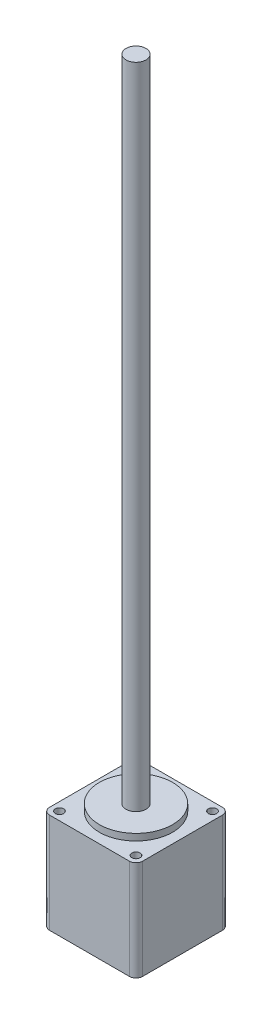
ISO-10303-21;
HEADER;
FILE_DESCRIPTION(('STEP AP214'),'2;1');
FILE_NAME('part.step','',(''),(''),'','','');
FILE_SCHEMA(('AUTOMOTIVE_DESIGN { 1 0 10303 214 1 1 1 1 }'));
ENDSEC;
DATA;
#1=APPLICATION_CONTEXT('core data for automotive mechanical design processes');
#2=APPLICATION_PROTOCOL_DEFINITION('international standard','automotive_design',2000,#1);
#3=PRODUCT_CONTEXT('',#1,'mechanical');
#4=PRODUCT('Part','Part','',(#3));
#5=PRODUCT_RELATED_PRODUCT_CATEGORY('part','',(#4));
#6=PRODUCT_DEFINITION_FORMATION('','',#4);
#7=PRODUCT_DEFINITION_CONTEXT('part definition',#1,'design');
#8=PRODUCT_DEFINITION('design','',#6,#7);
#9=PRODUCT_DEFINITION_SHAPE('','',#8);
#10=(LENGTH_UNIT() NAMED_UNIT(*) SI_UNIT(.MILLI.,.METRE.));
#11=(NAMED_UNIT(*) PLANE_ANGLE_UNIT() SI_UNIT($,.RADIAN.));
#12=(NAMED_UNIT(*) SI_UNIT($,.STERADIAN.) SOLID_ANGLE_UNIT());
#13=UNCERTAINTY_MEASURE_WITH_UNIT(LENGTH_MEASURE(1.E-05),#10,'distance_accuracy_value','');
#14=(GEOMETRIC_REPRESENTATION_CONTEXT(3) GLOBAL_UNCERTAINTY_ASSIGNED_CONTEXT((#13)) GLOBAL_UNIT_ASSIGNED_CONTEXT((#10,
#11,#12)) REPRESENTATION_CONTEXT('',''));
#15=CARTESIAN_POINT('',(0.,0.,0.));
#16=DIRECTION('',(0.,0.,1.));
#17=DIRECTION('',(1.,0.,0.));
#18=AXIS2_PLACEMENT_3D('',#15,#16,#17);
#19=CARTESIAN_POINT('',(0.,30.,0.));
#20=DIRECTION('',(0.,-1.,0.));
#21=DIRECTION('',(0.,0.,-1.));
#22=AXIS2_PLACEMENT_3D('',#19,#20,#21);
#23=PLANE('',#22);
#24=CARTESIAN_POINT('',(14.,30.,-14.));
#25=DIRECTION('',(0.,1.,0.));
#26=DIRECTION('',(0.,0.,1.));
#27=AXIS2_PLACEMENT_3D('',#24,#25,#26);
#28=CIRCLE('',#27,11.);
#29=CARTESIAN_POINT('',(14.,30.,-3.));
#30=VERTEX_POINT('',#29);
#31=EDGE_CURVE('E219',#30,#30,#28,.T.);
#32=ORIENTED_EDGE('',*,*,#31,.F.);
#33=EDGE_LOOP('',(#32));
#34=FACE_BOUND('',#33,.T.);
#35=DIRECTION('',(-1.,0.,0.));
#36=VECTOR('',#35,1.);
#37=CARTESIAN_POINT('',(0.,30.,-28.));
#38=LINE('',#37,#36);
#39=CARTESIAN_POINT('',(26.,30.,-28.));
#40=VERTEX_POINT('',#39);
#41=CARTESIAN_POINT('',(2.,30.,-28.));
#42=VERTEX_POINT('',#41);
#43=EDGE_CURVE('E156',#40,#42,#38,.T.);
#44=ORIENTED_EDGE('',*,*,#43,.T.);
#45=CARTESIAN_POINT('',(2.,30.,-26.));
#46=DIRECTION('',(0.,-1.,0.));
#47=DIRECTION('',(0.,0.,-1.));
#48=AXIS2_PLACEMENT_3D('',#45,#46,#47);
#49=CIRCLE('',#48,2.);
#50=CARTESIAN_POINT('',(0.,30.,-26.));
#51=VERTEX_POINT('',#50);
#52=EDGE_CURVE('E186',#42,#51,#49,.F.);
#53=ORIENTED_EDGE('',*,*,#52,.T.);
#54=DIRECTION('',(0.,0.,1.));
#55=VECTOR('',#54,1.);
#56=CARTESIAN_POINT('',(0.,30.,0.));
#57=LINE('',#56,#55);
#58=CARTESIAN_POINT('',(0.,30.,-2.));
#59=VERTEX_POINT('',#58);
#60=EDGE_CURVE('E134',#51,#59,#57,.T.);
#61=ORIENTED_EDGE('',*,*,#60,.T.);
#62=CARTESIAN_POINT('',(2.,30.,-2.));
#63=DIRECTION('',(0.,-1.,0.));
#64=DIRECTION('',(0.,0.,-1.));
#65=AXIS2_PLACEMENT_3D('',#62,#63,#64);
#66=CIRCLE('',#65,2.);
#67=CARTESIAN_POINT('',(2.,30.,0.));
#68=VERTEX_POINT('',#67);
#69=EDGE_CURVE('E180',#59,#68,#66,.F.);
#70=ORIENTED_EDGE('',*,*,#69,.T.);
#71=DIRECTION('',(1.,0.,0.));
#72=VECTOR('',#71,1.);
#73=CARTESIAN_POINT('',(0.,30.,0.));
#74=LINE('',#73,#72);
#75=CARTESIAN_POINT('',(26.,30.,0.));
#76=VERTEX_POINT('',#75);
#77=EDGE_CURVE('E199',#68,#76,#74,.T.);
#78=ORIENTED_EDGE('',*,*,#77,.T.);
#79=CARTESIAN_POINT('',(26.,30.,-2.));
#80=DIRECTION('',(0.,-1.,0.));
#81=DIRECTION('',(0.,0.,-1.));
#82=AXIS2_PLACEMENT_3D('',#79,#80,#81);
#83=CIRCLE('',#82,2.);
#84=CARTESIAN_POINT('',(28.,30.,-2.));
#85=VERTEX_POINT('',#84);
#86=EDGE_CURVE('E68',#76,#85,#83,.F.);
#87=ORIENTED_EDGE('',*,*,#86,.T.);
#88=DIRECTION('',(0.,0.,-1.));
#89=VECTOR('',#88,1.);
#90=CARTESIAN_POINT('',(28.,30.,0.));
#91=LINE('',#90,#89);
#92=CARTESIAN_POINT('',(28.,30.,-26.));
#93=VERTEX_POINT('',#92);
#94=EDGE_CURVE('E206',#85,#93,#91,.T.);
#95=ORIENTED_EDGE('',*,*,#94,.T.);
#96=CARTESIAN_POINT('',(26.,30.,-26.));
#97=DIRECTION('',(0.,-1.,0.));
#98=DIRECTION('',(0.,0.,-1.));
#99=AXIS2_PLACEMENT_3D('',#96,#97,#98);
#100=CIRCLE('',#99,2.);
#101=EDGE_CURVE('E183',#93,#40,#100,.F.);
#102=ORIENTED_EDGE('',*,*,#101,.T.);
#103=EDGE_LOOP('',(#44,#53,#61,#70,#78,#87,#95,#102));
#104=FACE_BOUND('',#103,.T.);
#105=CARTESIAN_POINT('',(2.5,30.,-25.5));
#106=DIRECTION('',(0.,1.,0.));
#107=DIRECTION('',(0.,0.,1.));
#108=AXIS2_PLACEMENT_3D('',#105,#106,#107);
#109=CIRCLE('',#108,1.25);
#110=CARTESIAN_POINT('',(2.5,30.,-24.25));
#111=VERTEX_POINT('',#110);
#112=EDGE_CURVE('E145',#111,#111,#109,.T.);
#113=ORIENTED_EDGE('',*,*,#112,.F.);
#114=EDGE_LOOP('',(#113));
#115=FACE_BOUND('',#114,.T.);
#116=CARTESIAN_POINT('',(2.5,30.,-2.5));
#117=DIRECTION('',(0.,1.,0.));
#118=DIRECTION('',(0.,0.,1.));
#119=AXIS2_PLACEMENT_3D('',#116,#117,#118);
#120=CIRCLE('',#119,1.25);
#121=CARTESIAN_POINT('',(2.5,30.,-1.25));
#122=VERTEX_POINT('',#121);
#123=EDGE_CURVE('E229',#122,#122,#120,.T.);
#124=ORIENTED_EDGE('',*,*,#123,.F.);
#125=EDGE_LOOP('',(#124));
#126=FACE_BOUND('',#125,.T.);
#127=CARTESIAN_POINT('',(25.5,30.,-2.5));
#128=DIRECTION('',(0.,1.,0.));
#129=DIRECTION('',(0.,0.,1.));
#130=AXIS2_PLACEMENT_3D('',#127,#128,#129);
#131=CIRCLE('',#130,1.25);
#132=CARTESIAN_POINT('',(25.5,30.,-1.25));
#133=VERTEX_POINT('',#132);
#134=EDGE_CURVE('E235',#133,#133,#131,.T.);
#135=ORIENTED_EDGE('',*,*,#134,.F.);
#136=EDGE_LOOP('',(#135));
#137=FACE_BOUND('',#136,.T.);
#138=CARTESIAN_POINT('',(25.5,30.,-25.5));
#139=DIRECTION('',(0.,1.,0.));
#140=DIRECTION('',(0.,0.,1.));
#141=AXIS2_PLACEMENT_3D('',#138,#139,#140);
#142=CIRCLE('',#141,1.25);
#143=CARTESIAN_POINT('',(25.5,30.,-24.25));
#144=VERTEX_POINT('',#143);
#145=EDGE_CURVE('E243',#144,#144,#142,.T.);
#146=ORIENTED_EDGE('',*,*,#145,.F.);
#147=EDGE_LOOP('',(#146));
#148=FACE_BOUND('',#147,.T.);
#149=ADVANCED_FACE('F45',(#34,#104,#115,#126,#137,#148),#23,.F.);
#150=CARTESIAN_POINT('',(0.,0.,0.));
#151=DIRECTION('',(0.,-1.,0.));
#152=DIRECTION('',(0.,0.,-1.));
#153=AXIS2_PLACEMENT_3D('',#150,#151,#152);
#154=PLANE('',#153);
#155=CARTESIAN_POINT('',(25.5,0.,-2.5));
#156=DIRECTION('',(0.,1.,0.));
#157=DIRECTION('',(0.,0.,1.));
#158=AXIS2_PLACEMENT_3D('',#155,#156,#157);
#159=CIRCLE('',#158,1.25);
#160=CARTESIAN_POINT('',(25.5,0.,-1.25));
#161=VERTEX_POINT('',#160);
#162=EDGE_CURVE('E239',#161,#161,#159,.T.);
#163=ORIENTED_EDGE('',*,*,#162,.T.);
#164=EDGE_LOOP('',(#163));
#165=FACE_BOUND('',#164,.T.);
#166=CARTESIAN_POINT('',(2.5,0.,-25.5));
#167=DIRECTION('',(0.,1.,0.));
#168=DIRECTION('',(0.,0.,1.));
#169=AXIS2_PLACEMENT_3D('',#166,#167,#168);
#170=CIRCLE('',#169,1.25);
#171=CARTESIAN_POINT('',(2.5,0.,-24.25));
#172=VERTEX_POINT('',#171);
#173=EDGE_CURVE('E153',#172,#172,#170,.T.);
#174=ORIENTED_EDGE('',*,*,#173,.T.);
#175=EDGE_LOOP('',(#174));
#176=FACE_BOUND('',#175,.T.);
#177=DIRECTION('',(0.,0.,1.));
#178=VECTOR('',#177,1.);
#179=CARTESIAN_POINT('',(0.,0.,0.));
#180=LINE('',#179,#178);
#181=CARTESIAN_POINT('',(0.,0.,-26.));
#182=VERTEX_POINT('',#181);
#183=CARTESIAN_POINT('',(0.,0.,-2.));
#184=VERTEX_POINT('',#183);
#185=EDGE_CURVE('E131',#182,#184,#180,.T.);
#186=ORIENTED_EDGE('',*,*,#185,.F.);
#187=CARTESIAN_POINT('',(2.,0.,-26.));
#188=DIRECTION('',(0.,-1.,0.));
#189=DIRECTION('',(0.,0.,-1.));
#190=AXIS2_PLACEMENT_3D('',#187,#188,#189);
#191=CIRCLE('',#190,2.);
#192=CARTESIAN_POINT('',(2.,0.,-28.));
#193=VERTEX_POINT('',#192);
#194=EDGE_CURVE('E113',#182,#193,#191,.T.);
#195=ORIENTED_EDGE('',*,*,#194,.T.);
#196=DIRECTION('',(-1.,0.,0.));
#197=VECTOR('',#196,1.);
#198=CARTESIAN_POINT('',(0.,0.,-28.));
#199=LINE('',#198,#197);
#200=CARTESIAN_POINT('',(26.,0.,-28.));
#201=VERTEX_POINT('',#200);
#202=EDGE_CURVE('E161',#201,#193,#199,.T.);
#203=ORIENTED_EDGE('',*,*,#202,.F.);
#204=CARTESIAN_POINT('',(26.,0.,-26.));
#205=DIRECTION('',(0.,-1.,0.));
#206=DIRECTION('',(0.,0.,-1.));
#207=AXIS2_PLACEMENT_3D('',#204,#205,#206);
#208=CIRCLE('',#207,2.);
#209=CARTESIAN_POINT('',(28.,0.,-26.));
#210=VERTEX_POINT('',#209);
#211=EDGE_CURVE('E125',#201,#210,#208,.T.);
#212=ORIENTED_EDGE('',*,*,#211,.T.);
#213=DIRECTION('',(0.,0.,-1.));
#214=VECTOR('',#213,1.);
#215=CARTESIAN_POINT('',(28.,0.,0.));
#216=LINE('',#215,#214);
#217=CARTESIAN_POINT('',(28.,0.,-2.));
#218=VERTEX_POINT('',#217);
#219=EDGE_CURVE('E150',#218,#210,#216,.T.);
#220=ORIENTED_EDGE('',*,*,#219,.F.);
#221=CARTESIAN_POINT('',(26.,0.,-2.));
#222=DIRECTION('',(0.,-1.,0.));
#223=DIRECTION('',(0.,0.,-1.));
#224=AXIS2_PLACEMENT_3D('',#221,#222,#223);
#225=CIRCLE('',#224,2.);
#226=CARTESIAN_POINT('',(26.,0.,0.));
#227=VERTEX_POINT('',#226);
#228=EDGE_CURVE('E136',#218,#227,#225,.T.);
#229=ORIENTED_EDGE('',*,*,#228,.T.);
#230=DIRECTION('',(1.,0.,0.));
#231=VECTOR('',#230,1.);
#232=CARTESIAN_POINT('',(0.,0.,0.));
#233=LINE('',#232,#231);
#234=CARTESIAN_POINT('',(2.,0.,0.));
#235=VERTEX_POINT('',#234);
#236=EDGE_CURVE('E144',#235,#227,#233,.T.);
#237=ORIENTED_EDGE('',*,*,#236,.F.);
#238=CARTESIAN_POINT('',(2.,0.,-2.));
#239=DIRECTION('',(0.,-1.,0.));
#240=DIRECTION('',(0.,0.,-1.));
#241=AXIS2_PLACEMENT_3D('',#238,#239,#240);
#242=CIRCLE('',#241,2.);
#243=EDGE_CURVE('E142',#235,#184,#242,.T.);
#244=ORIENTED_EDGE('',*,*,#243,.T.);
#245=EDGE_LOOP('',(#186,#195,#203,#212,#220,#229,#237,#244));
#246=FACE_BOUND('',#245,.T.);
#247=CARTESIAN_POINT('',(2.5,0.,-2.5));
#248=DIRECTION('',(0.,1.,0.));
#249=DIRECTION('',(0.,0.,1.));
#250=AXIS2_PLACEMENT_3D('',#247,#248,#249);
#251=CIRCLE('',#250,1.25);
#252=CARTESIAN_POINT('',(2.5,0.,-1.25));
#253=VERTEX_POINT('',#252);
#254=EDGE_CURVE('E231',#253,#253,#251,.T.);
#255=ORIENTED_EDGE('',*,*,#254,.T.);
#256=EDGE_LOOP('',(#255));
#257=FACE_BOUND('',#256,.T.);
#258=CARTESIAN_POINT('',(25.5,0.,-25.5));
#259=DIRECTION('',(0.,1.,0.));
#260=DIRECTION('',(0.,0.,1.));
#261=AXIS2_PLACEMENT_3D('',#258,#259,#260);
#262=CIRCLE('',#261,1.25);
#263=CARTESIAN_POINT('',(25.5,0.,-24.25));
#264=VERTEX_POINT('',#263);
#265=EDGE_CURVE('E247',#264,#264,#262,.T.);
#266=ORIENTED_EDGE('',*,*,#265,.T.);
#267=EDGE_LOOP('',(#266));
#268=FACE_BOUND('',#267,.T.);
#269=ADVANCED_FACE('F139',(#165,#176,#246,#257,#268),#154,.T.);
#270=CARTESIAN_POINT('',(0.,30.,0.));
#271=DIRECTION('',(1.,0.,0.));
#272=DIRECTION('',(0.,0.,-1.));
#273=AXIS2_PLACEMENT_3D('',#270,#271,#272);
#274=PLANE('',#273);
#275=ORIENTED_EDGE('',*,*,#60,.F.);
#276=DIRECTION('',(0.,-1.,0.));
#277=VECTOR('',#276,1.);
#278=CARTESIAN_POINT('',(0.,30.,-26.));
#279=LINE('',#278,#277);
#280=EDGE_CURVE('E117',#51,#182,#279,.T.);
#281=ORIENTED_EDGE('',*,*,#280,.T.);
#282=ORIENTED_EDGE('',*,*,#185,.T.);
#283=DIRECTION('',(0.,-1.,0.));
#284=VECTOR('',#283,1.);
#285=CARTESIAN_POINT('',(0.,30.,-2.));
#286=LINE('',#285,#284);
#287=EDGE_CURVE('E137',#184,#59,#286,.F.);
#288=ORIENTED_EDGE('',*,*,#287,.T.);
#289=EDGE_LOOP('',(#275,#281,#282,#288));
#290=FACE_BOUND('',#289,.T.);
#291=ADVANCED_FACE('F130',(#290),#274,.F.);
#292=CARTESIAN_POINT('',(0.,30.,0.));
#293=DIRECTION('',(0.,0.,-1.));
#294=DIRECTION('',(-1.,0.,0.));
#295=AXIS2_PLACEMENT_3D('',#292,#293,#294);
#296=PLANE('',#295);
#297=ORIENTED_EDGE('',*,*,#77,.F.);
#298=DIRECTION('',(0.,-1.,0.));
#299=VECTOR('',#298,1.);
#300=CARTESIAN_POINT('',(2.,30.,0.));
#301=LINE('',#300,#299);
#302=EDGE_CURVE('E11',#68,#235,#301,.T.);
#303=ORIENTED_EDGE('',*,*,#302,.T.);
#304=ORIENTED_EDGE('',*,*,#236,.T.);
#305=DIRECTION('',(0.,-1.,0.));
#306=VECTOR('',#305,1.);
#307=CARTESIAN_POINT('',(26.,30.,0.));
#308=LINE('',#307,#306);
#309=EDGE_CURVE('E54',#227,#76,#308,.F.);
#310=ORIENTED_EDGE('',*,*,#309,.T.);
#311=EDGE_LOOP('',(#297,#303,#304,#310));
#312=FACE_BOUND('',#311,.T.);
#313=ADVANCED_FACE('F198',(#312),#296,.F.);
#314=CARTESIAN_POINT('',(28.,30.,0.));
#315=DIRECTION('',(-1.,0.,0.));
#316=DIRECTION('',(0.,0.,1.));
#317=AXIS2_PLACEMENT_3D('',#314,#315,#316);
#318=PLANE('',#317);
#319=ORIENTED_EDGE('',*,*,#219,.T.);
#320=DIRECTION('',(0.,-1.,0.));
#321=VECTOR('',#320,1.);
#322=CARTESIAN_POINT('',(28.,30.,-26.));
#323=LINE('',#322,#321);
#324=EDGE_CURVE('E61',#210,#93,#323,.F.);
#325=ORIENTED_EDGE('',*,*,#324,.T.);
#326=ORIENTED_EDGE('',*,*,#94,.F.);
#327=DIRECTION('',(0.,-1.,0.));
#328=VECTOR('',#327,1.);
#329=CARTESIAN_POINT('',(28.,30.,-2.));
#330=LINE('',#329,#328);
#331=EDGE_CURVE('E189',#85,#218,#330,.T.);
#332=ORIENTED_EDGE('',*,*,#331,.T.);
#333=EDGE_LOOP('',(#319,#325,#326,#332));
#334=FACE_BOUND('',#333,.T.);
#335=ADVANCED_FACE('F210',(#334),#318,.F.);
#336=CARTESIAN_POINT('',(0.,30.,-28.));
#337=DIRECTION('',(0.,0.,1.));
#338=DIRECTION('',(1.,0.,0.));
#339=AXIS2_PLACEMENT_3D('',#336,#337,#338);
#340=PLANE('',#339);
#341=ORIENTED_EDGE('',*,*,#202,.T.);
#342=DIRECTION('',(0.,-1.,0.));
#343=VECTOR('',#342,1.);
#344=CARTESIAN_POINT('',(2.,30.,-28.));
#345=LINE('',#344,#343);
#346=EDGE_CURVE('E118',#193,#42,#345,.F.);
#347=ORIENTED_EDGE('',*,*,#346,.T.);
#348=ORIENTED_EDGE('',*,*,#43,.F.);
#349=DIRECTION('',(0.,-1.,0.));
#350=VECTOR('',#349,1.);
#351=CARTESIAN_POINT('',(26.,30.,-28.));
#352=LINE('',#351,#350);
#353=EDGE_CURVE('E124',#40,#201,#352,.T.);
#354=ORIENTED_EDGE('',*,*,#353,.T.);
#355=EDGE_LOOP('',(#341,#347,#348,#354));
#356=FACE_BOUND('',#355,.T.);
#357=ADVANCED_FACE('F217',(#356),#340,.F.);
#358=CARTESIAN_POINT('',(2.5,30.,-25.5));
#359=DIRECTION('',(0.,-1.,0.));
#360=DIRECTION('',(0.,0.,-1.));
#361=AXIS2_PLACEMENT_3D('',#358,#359,#360);
#362=CYLINDRICAL_SURFACE('',#361,1.25);
#363=ORIENTED_EDGE('',*,*,#112,.T.);
#364=EDGE_LOOP('',(#363));
#365=FACE_BOUND('',#364,.T.);
#366=ORIENTED_EDGE('',*,*,#173,.F.);
#367=EDGE_LOOP('',(#366));
#368=FACE_BOUND('',#367,.T.);
#369=ADVANCED_FACE('F296',(#365,#368),#362,.F.);
#370=CARTESIAN_POINT('',(2.5,30.,-2.5));
#371=DIRECTION('',(0.,-1.,0.));
#372=DIRECTION('',(0.,0.,-1.));
#373=AXIS2_PLACEMENT_3D('',#370,#371,#372);
#374=CYLINDRICAL_SURFACE('',#373,1.25);
#375=ORIENTED_EDGE('',*,*,#123,.T.);
#376=EDGE_LOOP('',(#375));
#377=FACE_BOUND('',#376,.T.);
#378=ORIENTED_EDGE('',*,*,#254,.F.);
#379=EDGE_LOOP('',(#378));
#380=FACE_BOUND('',#379,.T.);
#381=ADVANCED_FACE('F379',(#377,#380),#374,.F.);
#382=CARTESIAN_POINT('',(25.5,30.,-2.5));
#383=DIRECTION('',(0.,-1.,0.));
#384=DIRECTION('',(0.,0.,-1.));
#385=AXIS2_PLACEMENT_3D('',#382,#383,#384);
#386=CYLINDRICAL_SURFACE('',#385,1.25);
#387=ORIENTED_EDGE('',*,*,#134,.T.);
#388=EDGE_LOOP('',(#387));
#389=FACE_BOUND('',#388,.T.);
#390=ORIENTED_EDGE('',*,*,#162,.F.);
#391=EDGE_LOOP('',(#390));
#392=FACE_BOUND('',#391,.T.);
#393=ADVANCED_FACE('F369',(#389,#392),#386,.F.);
#394=CARTESIAN_POINT('',(25.5,30.,-25.5));
#395=DIRECTION('',(0.,-1.,0.));
#396=DIRECTION('',(0.,0.,-1.));
#397=AXIS2_PLACEMENT_3D('',#394,#395,#396);
#398=CYLINDRICAL_SURFACE('',#397,1.25);
#399=ORIENTED_EDGE('',*,*,#145,.T.);
#400=EDGE_LOOP('',(#399));
#401=FACE_BOUND('',#400,.T.);
#402=ORIENTED_EDGE('',*,*,#265,.F.);
#403=EDGE_LOOP('',(#402));
#404=FACE_BOUND('',#403,.T.);
#405=ADVANCED_FACE('F283',(#401,#404),#398,.F.);
#406=CARTESIAN_POINT('',(14.,32.,-14.));
#407=DIRECTION('',(0.,-1.,0.));
#408=DIRECTION('',(0.,0.,-1.));
#409=AXIS2_PLACEMENT_3D('',#406,#407,#408);
#410=CYLINDRICAL_SURFACE('',#409,11.);
#411=CARTESIAN_POINT('',(14.,32.,-14.));
#412=DIRECTION('',(0.,1.,0.));
#413=DIRECTION('',(0.,0.,1.));
#414=AXIS2_PLACEMENT_3D('',#411,#412,#413);
#415=CIRCLE('',#414,11.);
#416=CARTESIAN_POINT('',(14.,32.,-3.));
#417=VERTEX_POINT('',#416);
#418=EDGE_CURVE('E251',#417,#417,#415,.T.);
#419=ORIENTED_EDGE('',*,*,#418,.F.);
#420=EDGE_LOOP('',(#419));
#421=FACE_BOUND('',#420,.T.);
#422=ORIENTED_EDGE('',*,*,#31,.T.);
#423=EDGE_LOOP('',(#422));
#424=FACE_BOUND('',#423,.T.);
#425=ADVANCED_FACE('F277',(#421,#424),#410,.T.);
#426=CARTESIAN_POINT('',(14.,32.,-14.));
#427=DIRECTION('',(0.,1.,0.));
#428=DIRECTION('',(0.,0.,1.));
#429=AXIS2_PLACEMENT_3D('',#426,#427,#428);
#430=PLANE('',#429);
#431=CARTESIAN_POINT('',(14.,32.,-14.));
#432=DIRECTION('',(0.,1.,0.));
#433=DIRECTION('',(0.,0.,1.));
#434=AXIS2_PLACEMENT_3D('',#431,#432,#433);
#435=CIRCLE('',#434,3.);
#436=CARTESIAN_POINT('',(14.,32.,-11.));
#437=VERTEX_POINT('',#436);
#438=EDGE_CURVE('E165',#437,#437,#435,.T.);
#439=ORIENTED_EDGE('',*,*,#438,.F.);
#440=EDGE_LOOP('',(#439));
#441=FACE_BOUND('',#440,.T.);
#442=ORIENTED_EDGE('',*,*,#418,.T.);
#443=EDGE_LOOP('',(#442));
#444=FACE_BOUND('',#443,.T.);
#445=ADVANCED_FACE('F271',(#441,#444),#430,.T.);
#446=CARTESIAN_POINT('',(14.,227.,-14.));
#447=DIRECTION('',(0.,-1.,0.));
#448=DIRECTION('',(0.,0.,-1.));
#449=AXIS2_PLACEMENT_3D('',#446,#447,#448);
#450=CYLINDRICAL_SURFACE('',#449,3.);
#451=CARTESIAN_POINT('',(14.,227.,-14.));
#452=DIRECTION('',(0.,1.,0.));
#453=DIRECTION('',(0.,0.,1.));
#454=AXIS2_PLACEMENT_3D('',#451,#452,#453);
#455=CIRCLE('',#454,3.);
#456=CARTESIAN_POINT('',(14.,227.,-11.));
#457=VERTEX_POINT('',#456);
#458=EDGE_CURVE('E258',#457,#457,#455,.T.);
#459=ORIENTED_EDGE('',*,*,#458,.F.);
#460=EDGE_LOOP('',(#459));
#461=FACE_BOUND('',#460,.T.);
#462=ORIENTED_EDGE('',*,*,#438,.T.);
#463=EDGE_LOOP('',(#462));
#464=FACE_BOUND('',#463,.T.);
#465=ADVANCED_FACE('F268',(#461,#464),#450,.T.);
#466=CARTESIAN_POINT('',(14.,227.,-14.));
#467=DIRECTION('',(0.,1.,0.));
#468=DIRECTION('',(0.,0.,1.));
#469=AXIS2_PLACEMENT_3D('',#466,#467,#468);
#470=PLANE('',#469);
#471=ORIENTED_EDGE('',*,*,#458,.T.);
#472=EDGE_LOOP('',(#471));
#473=FACE_BOUND('',#472,.T.);
#474=ADVANCED_FACE('F266',(#473),#470,.T.);
#475=CARTESIAN_POINT('',(2.,30.,-26.));
#476=DIRECTION('',(0.,-1.,0.));
#477=DIRECTION('',(0.,0.,-1.));
#478=AXIS2_PLACEMENT_3D('',#475,#476,#477);
#479=CYLINDRICAL_SURFACE('',#478,2.);
#480=ORIENTED_EDGE('',*,*,#52,.F.);
#481=ORIENTED_EDGE('',*,*,#346,.F.);
#482=ORIENTED_EDGE('',*,*,#194,.F.);
#483=ORIENTED_EDGE('',*,*,#280,.F.);
#484=EDGE_LOOP('',(#480,#481,#482,#483));
#485=FACE_BOUND('',#484,.T.);
#486=ADVANCED_FACE('F116',(#485),#479,.T.);
#487=CARTESIAN_POINT('',(26.,30.,-26.));
#488=DIRECTION('',(0.,-1.,0.));
#489=DIRECTION('',(0.,0.,-1.));
#490=AXIS2_PLACEMENT_3D('',#487,#488,#489);
#491=CYLINDRICAL_SURFACE('',#490,2.);
#492=ORIENTED_EDGE('',*,*,#101,.F.);
#493=ORIENTED_EDGE('',*,*,#324,.F.);
#494=ORIENTED_EDGE('',*,*,#211,.F.);
#495=ORIENTED_EDGE('',*,*,#353,.F.);
#496=EDGE_LOOP('',(#492,#493,#494,#495));
#497=FACE_BOUND('',#496,.T.);
#498=ADVANCED_FACE('F214',(#497),#491,.T.);
#499=CARTESIAN_POINT('',(2.,30.,-2.));
#500=DIRECTION('',(0.,-1.,0.));
#501=DIRECTION('',(0.,0.,-1.));
#502=AXIS2_PLACEMENT_3D('',#499,#500,#501);
#503=CYLINDRICAL_SURFACE('',#502,2.);
#504=ORIENTED_EDGE('',*,*,#69,.F.);
#505=ORIENTED_EDGE('',*,*,#287,.F.);
#506=ORIENTED_EDGE('',*,*,#243,.F.);
#507=ORIENTED_EDGE('',*,*,#302,.F.);
#508=EDGE_LOOP('',(#504,#505,#506,#507));
#509=FACE_BOUND('',#508,.T.);
#510=ADVANCED_FACE('F310',(#509),#503,.T.);
#511=CARTESIAN_POINT('',(26.,30.,-2.));
#512=DIRECTION('',(0.,-1.,0.));
#513=DIRECTION('',(0.,0.,-1.));
#514=AXIS2_PLACEMENT_3D('',#511,#512,#513);
#515=CYLINDRICAL_SURFACE('',#514,2.);
#516=ORIENTED_EDGE('',*,*,#86,.F.);
#517=ORIENTED_EDGE('',*,*,#309,.F.);
#518=ORIENTED_EDGE('',*,*,#228,.F.);
#519=ORIENTED_EDGE('',*,*,#331,.F.);
#520=EDGE_LOOP('',(#516,#517,#518,#519));
#521=FACE_BOUND('',#520,.T.);
#522=ADVANCED_FACE('F47',(#521),#515,.T.);
#523=CLOSED_SHELL('',(#149,#269,#291,#313,#335,#357,#369,#381,#393,#405,#425,#445,#465,#474,
#486,#498,#510,#522));
#524=MANIFOLD_SOLID_BREP('B2',#523);
#525=ADVANCED_BREP_SHAPE_REPRESENTATION('',(#18,#524),#14);
#526=SHAPE_DEFINITION_REPRESENTATION(#9,#525);
ENDSEC;
END-ISO-10303-21;
